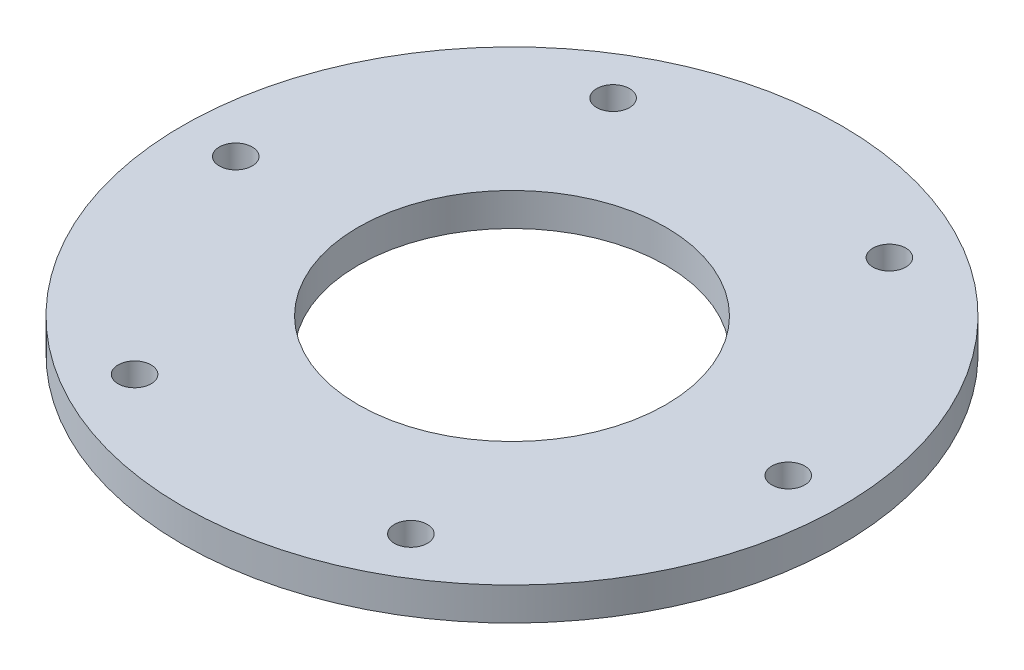
ISO-10303-21;
HEADER;
FILE_DESCRIPTION(('STEP AP214'),'2;1');
FILE_NAME('part.step','',(''),(''),'','','');
FILE_SCHEMA(('AUTOMOTIVE_DESIGN { 1 0 10303 214 1 1 1 1 }'));
ENDSEC;
DATA;
#1=APPLICATION_CONTEXT('core data for automotive mechanical design processes');
#2=APPLICATION_PROTOCOL_DEFINITION('international standard','automotive_design',2000,#1);
#3=PRODUCT_CONTEXT('',#1,'mechanical');
#4=PRODUCT('Part','Part','',(#3));
#5=PRODUCT_RELATED_PRODUCT_CATEGORY('part','',(#4));
#6=PRODUCT_DEFINITION_FORMATION('','',#4);
#7=PRODUCT_DEFINITION_CONTEXT('part definition',#1,'design');
#8=PRODUCT_DEFINITION('design','',#6,#7);
#9=PRODUCT_DEFINITION_SHAPE('','',#8);
#10=(LENGTH_UNIT() NAMED_UNIT(*) SI_UNIT(.MILLI.,.METRE.));
#11=(NAMED_UNIT(*) PLANE_ANGLE_UNIT() SI_UNIT($,.RADIAN.));
#12=(NAMED_UNIT(*) SI_UNIT($,.STERADIAN.) SOLID_ANGLE_UNIT());
#13=UNCERTAINTY_MEASURE_WITH_UNIT(LENGTH_MEASURE(1.E-05),#10,'distance_accuracy_value','');
#14=(GEOMETRIC_REPRESENTATION_CONTEXT(3) GLOBAL_UNCERTAINTY_ASSIGNED_CONTEXT((#13)) GLOBAL_UNIT_ASSIGNED_CONTEXT((#10,
#11,#12)) REPRESENTATION_CONTEXT('',''));
#15=CARTESIAN_POINT('',(0.,0.,0.));
#16=DIRECTION('',(0.,0.,1.));
#17=DIRECTION('',(1.,0.,0.));
#18=AXIS2_PLACEMENT_3D('',#15,#16,#17);
#19=CARTESIAN_POINT('',(0.,3.,0.));
#20=DIRECTION('',(0.,1.,0.));
#21=DIRECTION('',(0.,0.,1.));
#22=AXIS2_PLACEMENT_3D('',#19,#20,#21);
#23=PLANE('',#22);
#24=CARTESIAN_POINT('',(12.5749999999998,3.,21.7805389051788));
#25=DIRECTION('',(0.,1.,0.));
#26=DIRECTION('',(0.,0.,1.));
#27=AXIS2_PLACEMENT_3D('',#24,#25,#26);
#28=CIRCLE('',#27,1.5);
#29=CARTESIAN_POINT('',(12.5749999999998,3.,23.2805389051788));
#30=VERTEX_POINT('',#29);
#31=EDGE_CURVE('E71',#30,#30,#28,.T.);
#32=ORIENTED_EDGE('',*,*,#31,.F.);
#33=EDGE_LOOP('',(#32));
#34=FACE_BOUND('',#33,.T.);
#35=CARTESIAN_POINT('',(12.5750000000001,3.,-21.7805389051786));
#36=DIRECTION('',(0.,1.,0.));
#37=DIRECTION('',(0.,0.,1.));
#38=AXIS2_PLACEMENT_3D('',#35,#36,#37);
#39=CIRCLE('',#38,1.5);
#40=CARTESIAN_POINT('',(12.5750000000001,3.,-20.2805389051786));
#41=VERTEX_POINT('',#40);
#42=EDGE_CURVE('E59',#41,#41,#39,.T.);
#43=ORIENTED_EDGE('',*,*,#42,.F.);
#44=EDGE_LOOP('',(#43));
#45=FACE_BOUND('',#44,.T.);
#46=CARTESIAN_POINT('',(0.,3.,0.));
#47=DIRECTION('',(0.,1.,0.));
#48=DIRECTION('',(0.,0.,1.));
#49=AXIS2_PLACEMENT_3D('',#46,#47,#48);
#50=CIRCLE('',#49,14.);
#51=CARTESIAN_POINT('',(0.,3.,14.));
#52=VERTEX_POINT('',#51);
#53=EDGE_CURVE('E47',#52,#52,#50,.T.);
#54=ORIENTED_EDGE('',*,*,#53,.F.);
#55=EDGE_LOOP('',(#54));
#56=FACE_BOUND('',#55,.T.);
#57=CARTESIAN_POINT('',(0.,3.,0.));
#58=DIRECTION('',(0.,1.,0.));
#59=DIRECTION('',(0.,0.,1.));
#60=AXIS2_PLACEMENT_3D('',#57,#58,#59);
#61=CIRCLE('',#60,30.);
#62=CARTESIAN_POINT('',(0.,3.,30.));
#63=VERTEX_POINT('',#62);
#64=EDGE_CURVE('E10',#63,#63,#61,.T.);
#65=ORIENTED_EDGE('',*,*,#64,.T.);
#66=EDGE_LOOP('',(#65));
#67=FACE_BOUND('',#66,.T.);
#68=CARTESIAN_POINT('',(-25.15,3.,0.));
#69=DIRECTION('',(0.,1.,0.));
#70=DIRECTION('',(0.,0.,1.));
#71=AXIS2_PLACEMENT_3D('',#68,#69,#70);
#72=CIRCLE('',#71,1.5);
#73=CARTESIAN_POINT('',(-25.15,3.,1.5));
#74=VERTEX_POINT('',#73);
#75=EDGE_CURVE('E42',#74,#74,#72,.T.);
#76=ORIENTED_EDGE('',*,*,#75,.F.);
#77=EDGE_LOOP('',(#76));
#78=FACE_BOUND('',#77,.T.);
#79=CARTESIAN_POINT('',(-12.5749999999999,3.,-21.7805389051787));
#80=DIRECTION('',(0.,1.,0.));
#81=DIRECTION('',(0.,0.,1.));
#82=AXIS2_PLACEMENT_3D('',#79,#80,#81);
#83=CIRCLE('',#82,1.5);
#84=CARTESIAN_POINT('',(-12.5749999999999,3.,-20.2805389051787));
#85=VERTEX_POINT('',#84);
#86=EDGE_CURVE('E53',#85,#85,#83,.T.);
#87=ORIENTED_EDGE('',*,*,#86,.F.);
#88=EDGE_LOOP('',(#87));
#89=FACE_BOUND('',#88,.T.);
#90=CARTESIAN_POINT('',(25.15,3.,1.7562151134381E-13));
#91=DIRECTION('',(0.,1.,0.));
#92=DIRECTION('',(0.,0.,1.));
#93=AXIS2_PLACEMENT_3D('',#90,#91,#92);
#94=CIRCLE('',#93,1.5);
#95=CARTESIAN_POINT('',(25.15,3.,1.50000000000018));
#96=VERTEX_POINT('',#95);
#97=EDGE_CURVE('E65',#96,#96,#94,.T.);
#98=ORIENTED_EDGE('',*,*,#97,.F.);
#99=EDGE_LOOP('',(#98));
#100=FACE_BOUND('',#99,.T.);
#101=CARTESIAN_POINT('',(-12.5750000000003,3.,21.7805389051785));
#102=DIRECTION('',(0.,1.,0.));
#103=DIRECTION('',(0.,0.,1.));
#104=AXIS2_PLACEMENT_3D('',#101,#102,#103);
#105=CIRCLE('',#104,1.5);
#106=CARTESIAN_POINT('',(-12.5750000000003,3.,23.2805389051785));
#107=VERTEX_POINT('',#106);
#108=EDGE_CURVE('E77',#107,#107,#105,.T.);
#109=ORIENTED_EDGE('',*,*,#108,.F.);
#110=EDGE_LOOP('',(#109));
#111=FACE_BOUND('',#110,.T.);
#112=ADVANCED_FACE('F31',(#34,#45,#56,#67,#78,#89,#100,#111),#23,.T.);
#113=CARTESIAN_POINT('',(0.,0.,0.));
#114=DIRECTION('',(0.,1.,0.));
#115=DIRECTION('',(0.,0.,1.));
#116=AXIS2_PLACEMENT_3D('',#113,#114,#115);
#117=PLANE('',#116);
#118=CARTESIAN_POINT('',(0.,0.,0.));
#119=DIRECTION('',(0.,1.,0.));
#120=DIRECTION('',(0.,0.,1.));
#121=AXIS2_PLACEMENT_3D('',#118,#119,#120);
#122=CIRCLE('',#121,30.);
#123=CARTESIAN_POINT('',(0.,0.,30.));
#124=VERTEX_POINT('',#123);
#125=EDGE_CURVE('E35',#124,#124,#122,.T.);
#126=ORIENTED_EDGE('',*,*,#125,.F.);
#127=EDGE_LOOP('',(#126));
#128=FACE_BOUND('',#127,.T.);
#129=CARTESIAN_POINT('',(-25.15,0.,0.));
#130=DIRECTION('',(0.,1.,0.));
#131=DIRECTION('',(0.,0.,1.));
#132=AXIS2_PLACEMENT_3D('',#129,#130,#131);
#133=CIRCLE('',#132,1.5);
#134=CARTESIAN_POINT('',(-25.15,0.,1.5));
#135=VERTEX_POINT('',#134);
#136=EDGE_CURVE('E44',#135,#135,#133,.T.);
#137=ORIENTED_EDGE('',*,*,#136,.T.);
#138=EDGE_LOOP('',(#137));
#139=FACE_BOUND('',#138,.T.);
#140=CARTESIAN_POINT('',(0.,0.,0.));
#141=DIRECTION('',(0.,1.,0.));
#142=DIRECTION('',(0.,0.,1.));
#143=AXIS2_PLACEMENT_3D('',#140,#141,#142);
#144=CIRCLE('',#143,14.);
#145=CARTESIAN_POINT('',(0.,0.,14.));
#146=VERTEX_POINT('',#145);
#147=EDGE_CURVE('E50',#146,#146,#144,.T.);
#148=ORIENTED_EDGE('',*,*,#147,.T.);
#149=EDGE_LOOP('',(#148));
#150=FACE_BOUND('',#149,.T.);
#151=CARTESIAN_POINT('',(-12.5749999999999,0.,-21.7805389051787));
#152=DIRECTION('',(0.,1.,0.));
#153=DIRECTION('',(0.,0.,1.));
#154=AXIS2_PLACEMENT_3D('',#151,#152,#153);
#155=CIRCLE('',#154,1.5);
#156=CARTESIAN_POINT('',(-12.5749999999999,0.,-20.2805389051787));
#157=VERTEX_POINT('',#156);
#158=EDGE_CURVE('E56',#157,#157,#155,.T.);
#159=ORIENTED_EDGE('',*,*,#158,.T.);
#160=EDGE_LOOP('',(#159));
#161=FACE_BOUND('',#160,.T.);
#162=CARTESIAN_POINT('',(12.5750000000001,0.,-21.7805389051786));
#163=DIRECTION('',(0.,1.,0.));
#164=DIRECTION('',(0.,0.,1.));
#165=AXIS2_PLACEMENT_3D('',#162,#163,#164);
#166=CIRCLE('',#165,1.5);
#167=CARTESIAN_POINT('',(12.5750000000001,0.,-20.2805389051786));
#168=VERTEX_POINT('',#167);
#169=EDGE_CURVE('E62',#168,#168,#166,.T.);
#170=ORIENTED_EDGE('',*,*,#169,.T.);
#171=EDGE_LOOP('',(#170));
#172=FACE_BOUND('',#171,.T.);
#173=CARTESIAN_POINT('',(25.15,0.,1.7562151134381E-13));
#174=DIRECTION('',(0.,1.,0.));
#175=DIRECTION('',(0.,0.,1.));
#176=AXIS2_PLACEMENT_3D('',#173,#174,#175);
#177=CIRCLE('',#176,1.5);
#178=CARTESIAN_POINT('',(25.15,0.,1.50000000000018));
#179=VERTEX_POINT('',#178);
#180=EDGE_CURVE('E68',#179,#179,#177,.T.);
#181=ORIENTED_EDGE('',*,*,#180,.T.);
#182=EDGE_LOOP('',(#181));
#183=FACE_BOUND('',#182,.T.);
#184=CARTESIAN_POINT('',(12.5749999999998,0.,21.7805389051788));
#185=DIRECTION('',(0.,1.,0.));
#186=DIRECTION('',(0.,0.,1.));
#187=AXIS2_PLACEMENT_3D('',#184,#185,#186);
#188=CIRCLE('',#187,1.5);
#189=CARTESIAN_POINT('',(12.5749999999998,0.,23.2805389051788));
#190=VERTEX_POINT('',#189);
#191=EDGE_CURVE('E74',#190,#190,#188,.T.);
#192=ORIENTED_EDGE('',*,*,#191,.T.);
#193=EDGE_LOOP('',(#192));
#194=FACE_BOUND('',#193,.T.);
#195=CARTESIAN_POINT('',(-12.5750000000003,0.,21.7805389051785));
#196=DIRECTION('',(0.,1.,0.));
#197=DIRECTION('',(0.,0.,1.));
#198=AXIS2_PLACEMENT_3D('',#195,#196,#197);
#199=CIRCLE('',#198,1.5);
#200=CARTESIAN_POINT('',(-12.5750000000003,0.,23.2805389051785));
#201=VERTEX_POINT('',#200);
#202=EDGE_CURVE('E80',#201,#201,#199,.T.);
#203=ORIENTED_EDGE('',*,*,#202,.T.);
#204=EDGE_LOOP('',(#203));
#205=FACE_BOUND('',#204,.T.);
#206=ADVANCED_FACE('F90',(#128,#139,#150,#161,#172,#183,#194,#205),#117,.F.);
#207=CARTESIAN_POINT('',(0.,3.,0.));
#208=DIRECTION('',(0.,-1.,0.));
#209=DIRECTION('',(0.,0.,-1.));
#210=AXIS2_PLACEMENT_3D('',#207,#208,#209);
#211=CYLINDRICAL_SURFACE('',#210,30.);
#212=ORIENTED_EDGE('',*,*,#64,.F.);
#213=EDGE_LOOP('',(#212));
#214=FACE_BOUND('',#213,.T.);
#215=ORIENTED_EDGE('',*,*,#125,.T.);
#216=EDGE_LOOP('',(#215));
#217=FACE_BOUND('',#216,.T.);
#218=ADVANCED_FACE('F33',(#214,#217),#211,.T.);
#219=CARTESIAN_POINT('',(-25.15,3.,0.));
#220=DIRECTION('',(0.,-1.,0.));
#221=DIRECTION('',(0.,0.,-1.));
#222=AXIS2_PLACEMENT_3D('',#219,#220,#221);
#223=CYLINDRICAL_SURFACE('',#222,1.5);
#224=ORIENTED_EDGE('',*,*,#75,.T.);
#225=EDGE_LOOP('',(#224));
#226=FACE_BOUND('',#225,.T.);
#227=ORIENTED_EDGE('',*,*,#136,.F.);
#228=EDGE_LOOP('',(#227));
#229=FACE_BOUND('',#228,.T.);
#230=ADVANCED_FACE('F100',(#226,#229),#223,.F.);
#231=CARTESIAN_POINT('',(0.,3.,0.));
#232=DIRECTION('',(0.,-1.,0.));
#233=DIRECTION('',(0.,0.,-1.));
#234=AXIS2_PLACEMENT_3D('',#231,#232,#233);
#235=CYLINDRICAL_SURFACE('',#234,14.);
#236=ORIENTED_EDGE('',*,*,#53,.T.);
#237=EDGE_LOOP('',(#236));
#238=FACE_BOUND('',#237,.T.);
#239=ORIENTED_EDGE('',*,*,#147,.F.);
#240=EDGE_LOOP('',(#239));
#241=FACE_BOUND('',#240,.T.);
#242=ADVANCED_FACE('F103',(#238,#241),#235,.F.);
#243=CARTESIAN_POINT('',(-12.5749999999999,3.,-21.7805389051787));
#244=DIRECTION('',(0.,-1.,0.));
#245=DIRECTION('',(0.,0.,-1.));
#246=AXIS2_PLACEMENT_3D('',#243,#244,#245);
#247=CYLINDRICAL_SURFACE('',#246,1.5);
#248=ORIENTED_EDGE('',*,*,#86,.T.);
#249=EDGE_LOOP('',(#248));
#250=FACE_BOUND('',#249,.T.);
#251=ORIENTED_EDGE('',*,*,#158,.F.);
#252=EDGE_LOOP('',(#251));
#253=FACE_BOUND('',#252,.T.);
#254=ADVANCED_FACE('F107',(#250,#253),#247,.F.);
#255=CARTESIAN_POINT('',(12.5750000000001,3.,-21.7805389051786));
#256=DIRECTION('',(0.,-1.,0.));
#257=DIRECTION('',(0.,0.,-1.));
#258=AXIS2_PLACEMENT_3D('',#255,#256,#257);
#259=CYLINDRICAL_SURFACE('',#258,1.5);
#260=ORIENTED_EDGE('',*,*,#42,.T.);
#261=EDGE_LOOP('',(#260));
#262=FACE_BOUND('',#261,.T.);
#263=ORIENTED_EDGE('',*,*,#169,.F.);
#264=EDGE_LOOP('',(#263));
#265=FACE_BOUND('',#264,.T.);
#266=ADVANCED_FACE('F111',(#262,#265),#259,.F.);
#267=CARTESIAN_POINT('',(25.15,3.,1.7562151134381E-13));
#268=DIRECTION('',(0.,-1.,0.));
#269=DIRECTION('',(0.,0.,-1.));
#270=AXIS2_PLACEMENT_3D('',#267,#268,#269);
#271=CYLINDRICAL_SURFACE('',#270,1.5);
#272=ORIENTED_EDGE('',*,*,#97,.T.);
#273=EDGE_LOOP('',(#272));
#274=FACE_BOUND('',#273,.T.);
#275=ORIENTED_EDGE('',*,*,#180,.F.);
#276=EDGE_LOOP('',(#275));
#277=FACE_BOUND('',#276,.T.);
#278=ADVANCED_FACE('F115',(#274,#277),#271,.F.);
#279=CARTESIAN_POINT('',(12.5749999999998,3.,21.7805389051788));
#280=DIRECTION('',(0.,-1.,0.));
#281=DIRECTION('',(0.,0.,-1.));
#282=AXIS2_PLACEMENT_3D('',#279,#280,#281);
#283=CYLINDRICAL_SURFACE('',#282,1.5);
#284=ORIENTED_EDGE('',*,*,#31,.T.);
#285=EDGE_LOOP('',(#284));
#286=FACE_BOUND('',#285,.T.);
#287=ORIENTED_EDGE('',*,*,#191,.F.);
#288=EDGE_LOOP('',(#287));
#289=FACE_BOUND('',#288,.T.);
#290=ADVANCED_FACE('F119',(#286,#289),#283,.F.);
#291=CARTESIAN_POINT('',(-12.5750000000003,3.,21.7805389051785));
#292=DIRECTION('',(0.,-1.,0.));
#293=DIRECTION('',(0.,0.,-1.));
#294=AXIS2_PLACEMENT_3D('',#291,#292,#293);
#295=CYLINDRICAL_SURFACE('',#294,1.5);
#296=ORIENTED_EDGE('',*,*,#108,.T.);
#297=EDGE_LOOP('',(#296));
#298=FACE_BOUND('',#297,.T.);
#299=ORIENTED_EDGE('',*,*,#202,.F.);
#300=EDGE_LOOP('',(#299));
#301=FACE_BOUND('',#300,.T.);
#302=ADVANCED_FACE('F86',(#298,#301),#295,.F.);
#303=CLOSED_SHELL('',(#112,#206,#218,#230,#242,#254,#266,#278,#290,#302));
#304=MANIFOLD_SOLID_BREP('B2',#303);
#305=ADVANCED_BREP_SHAPE_REPRESENTATION('',(#18,#304),#14);
#306=SHAPE_DEFINITION_REPRESENTATION(#9,#305);
ENDSEC;
END-ISO-10303-21;
